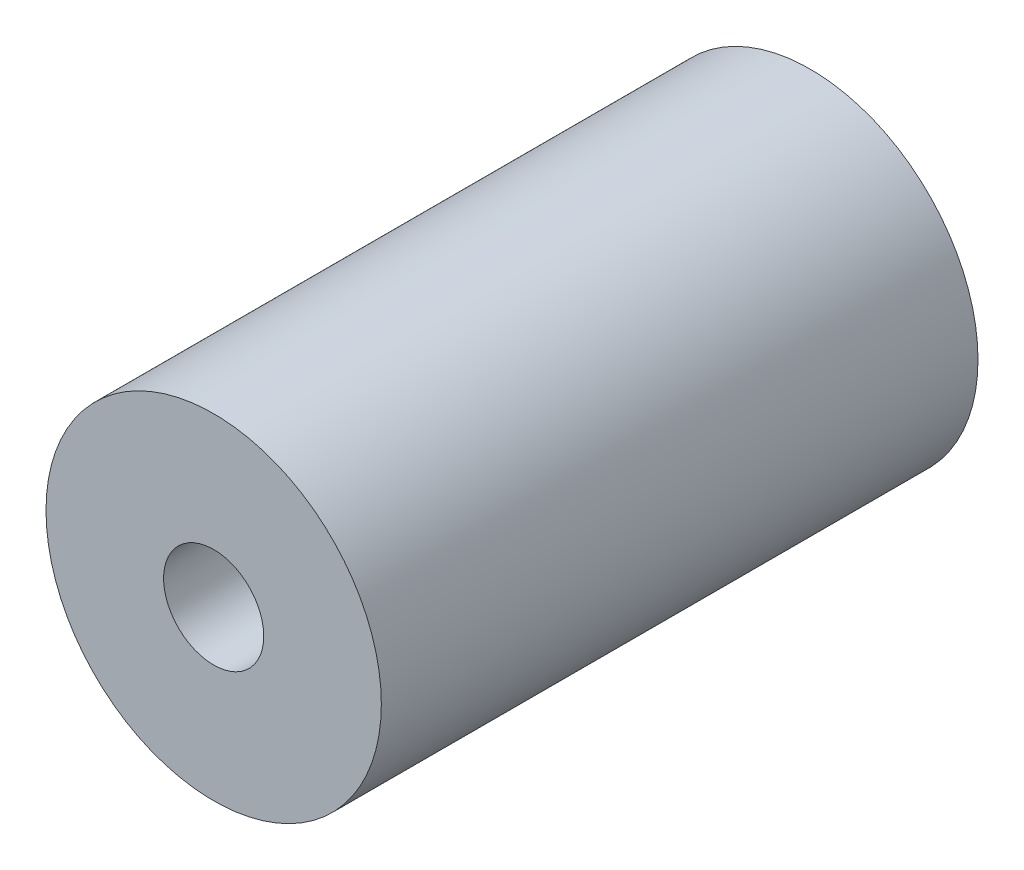
ISO-10303-21;
HEADER;
FILE_DESCRIPTION(('STEP AP214'),'2;1');
FILE_NAME('part.step','',(''),(''),'','','');
FILE_SCHEMA(('AUTOMOTIVE_DESIGN { 1 0 10303 214 1 1 1 1 }'));
ENDSEC;
DATA;
#1=APPLICATION_CONTEXT('core data for automotive mechanical design processes');
#2=APPLICATION_PROTOCOL_DEFINITION('international standard','automotive_design',2000,#1);
#3=PRODUCT_CONTEXT('',#1,'mechanical');
#4=PRODUCT('Part','Part','',(#3));
#5=PRODUCT_RELATED_PRODUCT_CATEGORY('part','',(#4));
#6=PRODUCT_DEFINITION_FORMATION('','',#4);
#7=PRODUCT_DEFINITION_CONTEXT('part definition',#1,'design');
#8=PRODUCT_DEFINITION('design','',#6,#7);
#9=PRODUCT_DEFINITION_SHAPE('','',#8);
#10=(LENGTH_UNIT() NAMED_UNIT(*) SI_UNIT(.MILLI.,.METRE.));
#11=(NAMED_UNIT(*) PLANE_ANGLE_UNIT() SI_UNIT($,.RADIAN.));
#12=(NAMED_UNIT(*) SI_UNIT($,.STERADIAN.) SOLID_ANGLE_UNIT());
#13=UNCERTAINTY_MEASURE_WITH_UNIT(LENGTH_MEASURE(1.E-05),#10,'distance_accuracy_value','');
#14=(GEOMETRIC_REPRESENTATION_CONTEXT(3) GLOBAL_UNCERTAINTY_ASSIGNED_CONTEXT((#13)) GLOBAL_UNIT_ASSIGNED_CONTEXT((#10,
#11,#12)) REPRESENTATION_CONTEXT('',''));
#15=CARTESIAN_POINT('',(0.,0.,0.));
#16=DIRECTION('',(0.,0.,1.));
#17=DIRECTION('',(1.,0.,0.));
#18=AXIS2_PLACEMENT_3D('',#15,#16,#17);
#19=CARTESIAN_POINT('',(0.,0.,-1.5));
#20=DIRECTION('',(0.,0.,1.));
#21=DIRECTION('',(1.,0.,0.));
#22=AXIS2_PLACEMENT_3D('',#19,#20,#21);
#23=CYLINDRICAL_SURFACE('',#22,0.63505);
#24=CARTESIAN_POINT('',(0.,0.,-1.5));
#25=DIRECTION('',(0.,0.,1.));
#26=DIRECTION('',(1.,0.,0.));
#27=AXIS2_PLACEMENT_3D('',#24,#25,#26);
#28=CIRCLE('',#27,0.63505);
#29=CARTESIAN_POINT('',(0.63505,0.,-1.5));
#30=VERTEX_POINT('',#29);
#31=EDGE_CURVE('E27',#30,#30,#28,.F.);
#32=ORIENTED_EDGE('',*,*,#31,.T.);
#33=EDGE_LOOP('',(#32));
#34=FACE_BOUND('',#33,.T.);
#35=CARTESIAN_POINT('',(0.,0.,6.0696));
#36=DIRECTION('',(0.,0.,1.));
#37=DIRECTION('',(1.,0.,0.));
#38=AXIS2_PLACEMENT_3D('',#35,#36,#37);
#39=CIRCLE('',#38,0.63505);
#40=CARTESIAN_POINT('',(0.635050000000002,0.,6.0696));
#41=VERTEX_POINT('',#40);
#42=EDGE_CURVE('E18',#41,#41,#39,.F.);
#43=ORIENTED_EDGE('',*,*,#42,.F.);
#44=EDGE_LOOP('',(#43));
#45=FACE_BOUND('',#44,.T.);
#46=ADVANCED_FACE('F15',(#34,#45),#23,.F.);
#47=CARTESIAN_POINT('',(0.,0.,6.0696));
#48=DIRECTION('',(0.,0.,1.));
#49=DIRECTION('',(1.,0.,0.));
#50=AXIS2_PLACEMENT_3D('',#47,#48,#49);
#51=PLANE('',#50);
#52=ORIENTED_EDGE('',*,*,#42,.T.);
#53=EDGE_LOOP('',(#52));
#54=FACE_BOUND('',#53,.T.);
#55=CARTESIAN_POINT('',(0.,0.,6.0696));
#56=DIRECTION('',(0.,0.,1.));
#57=DIRECTION('',(1.,0.,0.));
#58=AXIS2_PLACEMENT_3D('',#55,#56,#57);
#59=CIRCLE('',#58,2.1272);
#60=CARTESIAN_POINT('',(2.1272,0.,6.0696));
#61=VERTEX_POINT('',#60);
#62=EDGE_CURVE('E22',#61,#61,#59,.F.);
#63=ORIENTED_EDGE('',*,*,#62,.F.);
#64=EDGE_LOOP('',(#63));
#65=FACE_BOUND('',#64,.T.);
#66=ADVANCED_FACE('F35',(#54,#65),#51,.T.);
#67=CARTESIAN_POINT('',(0.,0.,-1.5));
#68=DIRECTION('',(0.,0.,1.));
#69=DIRECTION('',(1.,0.,0.));
#70=AXIS2_PLACEMENT_3D('',#67,#68,#69);
#71=PLANE('',#70);
#72=ORIENTED_EDGE('',*,*,#31,.F.);
#73=EDGE_LOOP('',(#72));
#74=FACE_BOUND('',#73,.T.);
#75=CARTESIAN_POINT('',(0.,0.,-1.5));
#76=DIRECTION('',(0.,0.,1.));
#77=DIRECTION('',(1.,0.,0.));
#78=AXIS2_PLACEMENT_3D('',#75,#76,#77);
#79=CIRCLE('',#78,2.1272);
#80=CARTESIAN_POINT('',(2.1272,0.,-1.5));
#81=VERTEX_POINT('',#80);
#82=EDGE_CURVE('E10',#81,#81,#79,.T.);
#83=ORIENTED_EDGE('',*,*,#82,.F.);
#84=EDGE_LOOP('',(#83));
#85=FACE_BOUND('',#84,.T.);
#86=ADVANCED_FACE('F43',(#74,#85),#71,.F.);
#87=CARTESIAN_POINT('',(0.,0.,-1.5));
#88=DIRECTION('',(0.,0.,1.));
#89=DIRECTION('',(1.,0.,0.));
#90=AXIS2_PLACEMENT_3D('',#87,#88,#89);
#91=CYLINDRICAL_SURFACE('',#90,2.1272);
#92=ORIENTED_EDGE('',*,*,#82,.T.);
#93=EDGE_LOOP('',(#92));
#94=FACE_BOUND('',#93,.T.);
#95=ORIENTED_EDGE('',*,*,#62,.T.);
#96=EDGE_LOOP('',(#95));
#97=FACE_BOUND('',#96,.T.);
#98=ADVANCED_FACE('F44',(#94,#97),#91,.T.);
#99=CLOSED_SHELL('',(#46,#66,#86,#98));
#100=MANIFOLD_SOLID_BREP('B1',#99);
#101=ADVANCED_BREP_SHAPE_REPRESENTATION('',(#18,#100),#14);
#102=SHAPE_DEFINITION_REPRESENTATION(#9,#101);
ENDSEC;
END-ISO-10303-21;
